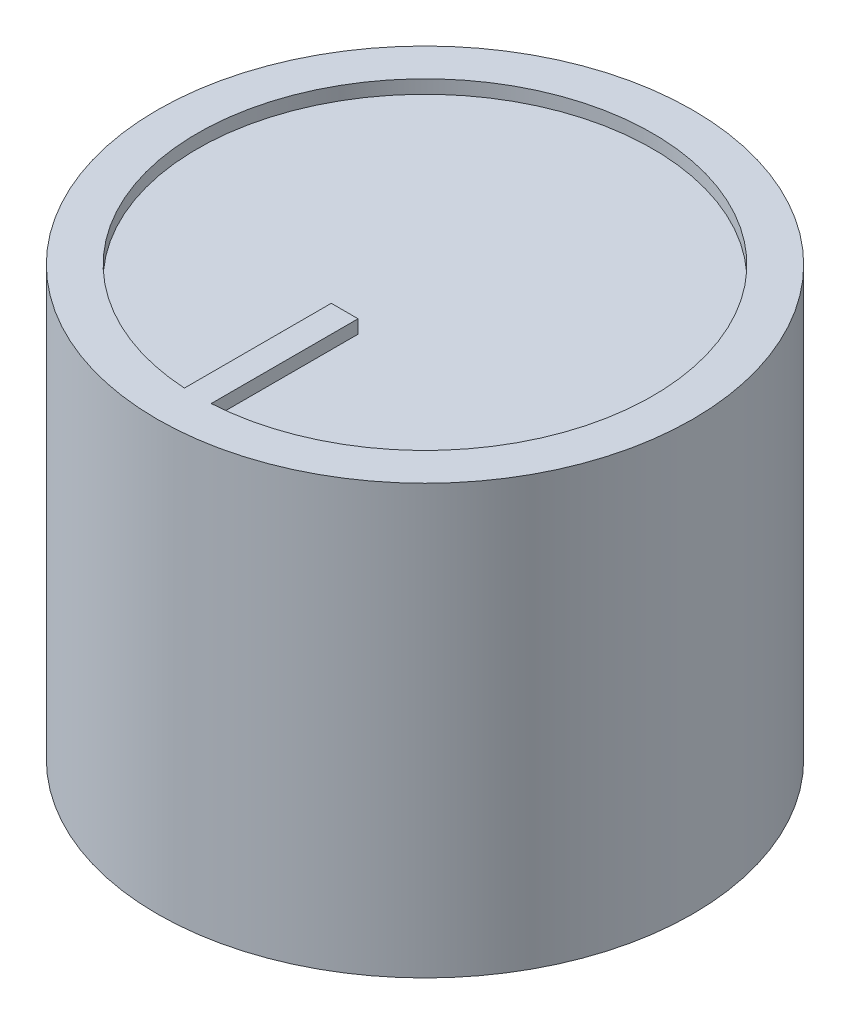
ISO-10303-21;
HEADER;
FILE_DESCRIPTION(('STEP AP214'),'2;1');
FILE_NAME('part.step','',(''),(''),'','','');
FILE_SCHEMA(('AUTOMOTIVE_DESIGN { 1 0 10303 214 1 1 1 1 }'));
ENDSEC;
DATA;
#1=APPLICATION_CONTEXT('core data for automotive mechanical design processes');
#2=APPLICATION_PROTOCOL_DEFINITION('international standard','automotive_design',2000,#1);
#3=PRODUCT_CONTEXT('',#1,'mechanical');
#4=PRODUCT('Part','Part','',(#3));
#5=PRODUCT_RELATED_PRODUCT_CATEGORY('part','',(#4));
#6=PRODUCT_DEFINITION_FORMATION('','',#4);
#7=PRODUCT_DEFINITION_CONTEXT('part definition',#1,'design');
#8=PRODUCT_DEFINITION('design','',#6,#7);
#9=PRODUCT_DEFINITION_SHAPE('','',#8);
#10=(LENGTH_UNIT() NAMED_UNIT(*) SI_UNIT(.MILLI.,.METRE.));
#11=(NAMED_UNIT(*) PLANE_ANGLE_UNIT() SI_UNIT($,.RADIAN.));
#12=(NAMED_UNIT(*) SI_UNIT($,.STERADIAN.) SOLID_ANGLE_UNIT());
#13=UNCERTAINTY_MEASURE_WITH_UNIT(LENGTH_MEASURE(1.E-05),#10,'distance_accuracy_value','');
#14=(GEOMETRIC_REPRESENTATION_CONTEXT(3) GLOBAL_UNCERTAINTY_ASSIGNED_CONTEXT((#13)) GLOBAL_UNIT_ASSIGNED_CONTEXT((#10,
#11,#12)) REPRESENTATION_CONTEXT('',''));
#15=CARTESIAN_POINT('',(0.,0.,0.));
#16=DIRECTION('',(0.,0.,1.));
#17=DIRECTION('',(1.,0.,0.));
#18=AXIS2_PLACEMENT_3D('',#15,#16,#17);
#19=CARTESIAN_POINT('',(0.,2.5,0.));
#20=DIRECTION('',(0.,1.,0.));
#21=DIRECTION('',(0.,0.,1.));
#22=AXIS2_PLACEMENT_3D('',#19,#20,#21);
#23=CYLINDRICAL_SURFACE('',#22,8.5);
#24=CARTESIAN_POINT('',(0.,3.,0.));
#25=DIRECTION('',(0.,1.,0.));
#26=DIRECTION('',(0.,0.,1.));
#27=AXIS2_PLACEMENT_3D('',#24,#25,#26);
#28=CIRCLE('',#27,8.5);
#29=CARTESIAN_POINT('',(0.49999999999999,3.,8.48528137423858));
#30=VERTEX_POINT('',#29);
#31=CARTESIAN_POINT('',(-0.500000000000007,3.,8.48528137423858));
#32=VERTEX_POINT('',#31);
#33=EDGE_CURVE('E83',#30,#32,#28,.T.);
#34=ORIENTED_EDGE('',*,*,#33,.T.);
#35=DIRECTION('',(0.,1.,0.));
#36=VECTOR('',#35,1.);
#37=CARTESIAN_POINT('',(-0.500000000000007,2.5,8.48528137423858));
#38=LINE('',#37,#36);
#39=CARTESIAN_POINT('',(-0.500000000000007,2.5,8.48528137423858));
#40=VERTEX_POINT('',#39);
#41=EDGE_CURVE('E102',#32,#40,#38,.F.);
#42=ORIENTED_EDGE('',*,*,#41,.T.);
#43=CARTESIAN_POINT('',(0.,2.5,0.));
#44=DIRECTION('',(0.,1.,0.));
#45=DIRECTION('',(0.,0.,1.));
#46=AXIS2_PLACEMENT_3D('',#43,#44,#45);
#47=CIRCLE('',#46,8.5);
#48=CARTESIAN_POINT('',(0.49999999999999,2.5,8.48528137423858));
#49=VERTEX_POINT('',#48);
#50=EDGE_CURVE('E104',#49,#40,#47,.T.);
#51=ORIENTED_EDGE('',*,*,#50,.F.);
#52=DIRECTION('',(0.,1.,0.));
#53=VECTOR('',#52,1.);
#54=CARTESIAN_POINT('',(0.49999999999999,2.5,8.48528137423858));
#55=LINE('',#54,#53);
#56=EDGE_CURVE('E86',#49,#30,#55,.T.);
#57=ORIENTED_EDGE('',*,*,#56,.T.);
#58=EDGE_LOOP('',(#34,#42,#51,#57));
#59=FACE_BOUND('',#58,.T.);
#60=ADVANCED_FACE('F34',(#59),#23,.F.);
#61=CARTESIAN_POINT('',(0.,2.5,8.5));
#62=DIRECTION('',(0.,1.,0.));
#63=DIRECTION('',(0.,0.,1.));
#64=AXIS2_PLACEMENT_3D('',#61,#62,#63);
#65=PLANE('',#64);
#66=ORIENTED_EDGE('',*,*,#50,.T.);
#67=DIRECTION('',(0.,0.,1.));
#68=VECTOR('',#67,1.);
#69=CARTESIAN_POINT('',(-0.500000000000007,2.5,3.));
#70=LINE('',#69,#68);
#71=CARTESIAN_POINT('',(-0.500000000000007,2.5,3.));
#72=VERTEX_POINT('',#71);
#73=EDGE_CURVE('E57',#72,#40,#70,.T.);
#74=ORIENTED_EDGE('',*,*,#73,.F.);
#75=DIRECTION('',(-1.,0.,0.));
#76=VECTOR('',#75,1.);
#77=CARTESIAN_POINT('',(-0.500000000000007,2.5,3.));
#78=LINE('',#77,#76);
#79=CARTESIAN_POINT('',(0.500000000000004,2.5,3.));
#80=VERTEX_POINT('',#79);
#81=EDGE_CURVE('E91',#80,#72,#78,.T.);
#82=ORIENTED_EDGE('',*,*,#81,.F.);
#83=DIRECTION('',(0.,0.,1.));
#84=VECTOR('',#83,1.);
#85=CARTESIAN_POINT('',(0.499999999999997,2.5,8.5));
#86=LINE('',#85,#84);
#87=EDGE_CURVE('E11',#80,#49,#86,.T.);
#88=ORIENTED_EDGE('',*,*,#87,.T.);
#89=EDGE_LOOP('',(#66,#74,#82,#88));
#90=FACE_BOUND('',#89,.T.);
#91=ADVANCED_FACE('F135',(#90),#65,.T.);
#92=CARTESIAN_POINT('',(0.,0.,0.));
#93=DIRECTION('',(0.,-1.,0.));
#94=DIRECTION('',(0.,0.,-1.));
#95=AXIS2_PLACEMENT_3D('',#92,#93,#94);
#96=PLANE('',#95);
#97=CARTESIAN_POINT('',(0.,0.,0.));
#98=DIRECTION('',(0.,1.,0.));
#99=DIRECTION('',(0.,0.,1.));
#100=AXIS2_PLACEMENT_3D('',#97,#98,#99);
#101=CIRCLE('',#100,3.);
#102=CARTESIAN_POINT('',(0.,0.,3.));
#103=VERTEX_POINT('',#102);
#104=EDGE_CURVE('E42',#103,#103,#101,.T.);
#105=ORIENTED_EDGE('',*,*,#104,.F.);
#106=EDGE_LOOP('',(#105));
#107=FACE_BOUND('',#106,.T.);
#108=ADVANCED_FACE('F36',(#107),#96,.T.);
#109=CARTESIAN_POINT('',(0.,2.5,0.));
#110=DIRECTION('',(0.,1.,0.));
#111=DIRECTION('',(0.,0.,1.));
#112=AXIS2_PLACEMENT_3D('',#109,#110,#111);
#113=CYLINDRICAL_SURFACE('',#112,3.);
#114=ORIENTED_EDGE('',*,*,#104,.T.);
#115=EDGE_LOOP('',(#114));
#116=FACE_BOUND('',#115,.T.);
#117=CARTESIAN_POINT('',(0.,-9.5,0.));
#118=DIRECTION('',(0.,1.,0.));
#119=DIRECTION('',(0.,0.,1.));
#120=AXIS2_PLACEMENT_3D('',#117,#118,#119);
#121=CIRCLE('',#120,3.);
#122=CARTESIAN_POINT('',(0.,-9.5,3.));
#123=VERTEX_POINT('',#122);
#124=EDGE_CURVE('E126',#123,#123,#121,.T.);
#125=ORIENTED_EDGE('',*,*,#124,.F.);
#126=EDGE_LOOP('',(#125));
#127=FACE_BOUND('',#126,.T.);
#128=ADVANCED_FACE('F131',(#116,#127),#113,.F.);
#129=CARTESIAN_POINT('',(0.,-9.5,3.));
#130=DIRECTION('',(0.,-1.,0.));
#131=DIRECTION('',(0.,0.,-1.));
#132=AXIS2_PLACEMENT_3D('',#129,#130,#131);
#133=PLANE('',#132);
#134=ORIENTED_EDGE('',*,*,#124,.T.);
#135=EDGE_LOOP('',(#134));
#136=FACE_BOUND('',#135,.T.);
#137=CARTESIAN_POINT('',(0.,-9.5,0.));
#138=DIRECTION('',(0.,1.,0.));
#139=DIRECTION('',(0.,0.,1.));
#140=AXIS2_PLACEMENT_3D('',#137,#138,#139);
#141=CIRCLE('',#140,4.5);
#142=CARTESIAN_POINT('',(0.,-9.5,4.50000000000001));
#143=VERTEX_POINT('',#142);
#144=EDGE_CURVE('E123',#143,#143,#141,.T.);
#145=ORIENTED_EDGE('',*,*,#144,.F.);
#146=EDGE_LOOP('',(#145));
#147=FACE_BOUND('',#146,.T.);
#148=ADVANCED_FACE('F140',(#136,#147),#133,.T.);
#149=CARTESIAN_POINT('',(0.,2.5,0.));
#150=DIRECTION('',(0.,1.,0.));
#151=DIRECTION('',(0.,0.,1.));
#152=AXIS2_PLACEMENT_3D('',#149,#150,#151);
#153=CYLINDRICAL_SURFACE('',#152,4.5);
#154=ORIENTED_EDGE('',*,*,#144,.T.);
#155=EDGE_LOOP('',(#154));
#156=FACE_BOUND('',#155,.T.);
#157=CARTESIAN_POINT('',(0.,-2.,0.));
#158=DIRECTION('',(0.,1.,0.));
#159=DIRECTION('',(0.,0.,1.));
#160=AXIS2_PLACEMENT_3D('',#157,#158,#159);
#161=CIRCLE('',#160,4.5);
#162=CARTESIAN_POINT('',(0.,-2.,4.50000000000001));
#163=VERTEX_POINT('',#162);
#164=EDGE_CURVE('E120',#163,#163,#161,.T.);
#165=ORIENTED_EDGE('',*,*,#164,.F.);
#166=EDGE_LOOP('',(#165));
#167=FACE_BOUND('',#166,.T.);
#168=ADVANCED_FACE('F168',(#156,#167),#153,.T.);
#169=CARTESIAN_POINT('',(0.,-2.,4.50000000000001));
#170=DIRECTION('',(0.,-1.,0.));
#171=DIRECTION('',(0.,0.,-1.));
#172=AXIS2_PLACEMENT_3D('',#169,#170,#171);
#173=PLANE('',#172);
#174=ORIENTED_EDGE('',*,*,#164,.T.);
#175=EDGE_LOOP('',(#174));
#176=FACE_BOUND('',#175,.T.);
#177=CARTESIAN_POINT('',(0.,-2.,0.));
#178=DIRECTION('',(0.,1.,0.));
#179=DIRECTION('',(0.,0.,1.));
#180=AXIS2_PLACEMENT_3D('',#177,#178,#179);
#181=CIRCLE('',#180,6.);
#182=CARTESIAN_POINT('',(0.,-2.,6.00000000000001));
#183=VERTEX_POINT('',#182);
#184=EDGE_CURVE('E117',#183,#183,#181,.T.);
#185=ORIENTED_EDGE('',*,*,#184,.F.);
#186=EDGE_LOOP('',(#185));
#187=FACE_BOUND('',#186,.T.);
#188=ADVANCED_FACE('F164',(#176,#187),#173,.T.);
#189=CARTESIAN_POINT('',(0.,2.5,0.));
#190=DIRECTION('',(0.,1.,0.));
#191=DIRECTION('',(0.,0.,1.));
#192=AXIS2_PLACEMENT_3D('',#189,#190,#191);
#193=CYLINDRICAL_SURFACE('',#192,6.);
#194=ORIENTED_EDGE('',*,*,#184,.T.);
#195=EDGE_LOOP('',(#194));
#196=FACE_BOUND('',#195,.T.);
#197=CARTESIAN_POINT('',(0.,-13.,0.));
#198=DIRECTION('',(0.,1.,0.));
#199=DIRECTION('',(0.,0.,1.));
#200=AXIS2_PLACEMENT_3D('',#197,#198,#199);
#201=CIRCLE('',#200,6.);
#202=CARTESIAN_POINT('',(0.,-13.,6.00000000000001));
#203=VERTEX_POINT('',#202);
#204=EDGE_CURVE('E114',#203,#203,#201,.T.);
#205=ORIENTED_EDGE('',*,*,#204,.F.);
#206=EDGE_LOOP('',(#205));
#207=FACE_BOUND('',#206,.T.);
#208=ADVANCED_FACE('F160',(#196,#207),#193,.F.);
#209=CARTESIAN_POINT('',(0.,-13.,6.00000000000001));
#210=DIRECTION('',(0.,-1.,0.));
#211=DIRECTION('',(0.,0.,-1.));
#212=AXIS2_PLACEMENT_3D('',#209,#210,#211);
#213=PLANE('',#212);
#214=ORIENTED_EDGE('',*,*,#204,.T.);
#215=EDGE_LOOP('',(#214));
#216=FACE_BOUND('',#215,.T.);
#217=CARTESIAN_POINT('',(0.,-13.,0.));
#218=DIRECTION('',(0.,1.,0.));
#219=DIRECTION('',(0.,0.,1.));
#220=AXIS2_PLACEMENT_3D('',#217,#218,#219);
#221=CIRCLE('',#220,10.);
#222=CARTESIAN_POINT('',(0.,-13.,10.));
#223=VERTEX_POINT('',#222);
#224=EDGE_CURVE('E111',#223,#223,#221,.T.);
#225=ORIENTED_EDGE('',*,*,#224,.F.);
#226=EDGE_LOOP('',(#225));
#227=FACE_BOUND('',#226,.T.);
#228=ADVANCED_FACE('F156',(#216,#227),#213,.T.);
#229=CARTESIAN_POINT('',(0.,2.5,0.));
#230=DIRECTION('',(0.,1.,0.));
#231=DIRECTION('',(0.,0.,1.));
#232=AXIS2_PLACEMENT_3D('',#229,#230,#231);
#233=CYLINDRICAL_SURFACE('',#232,10.);
#234=ORIENTED_EDGE('',*,*,#224,.T.);
#235=EDGE_LOOP('',(#234));
#236=FACE_BOUND('',#235,.T.);
#237=CARTESIAN_POINT('',(0.,3.,0.));
#238=DIRECTION('',(0.,1.,0.));
#239=DIRECTION('',(0.,0.,1.));
#240=AXIS2_PLACEMENT_3D('',#237,#238,#239);
#241=CIRCLE('',#240,10.);
#242=CARTESIAN_POINT('',(0.,3.,10.));
#243=VERTEX_POINT('',#242);
#244=EDGE_CURVE('E108',#243,#243,#241,.T.);
#245=ORIENTED_EDGE('',*,*,#244,.F.);
#246=EDGE_LOOP('',(#245));
#247=FACE_BOUND('',#246,.T.);
#248=ADVANCED_FACE('F153',(#236,#247),#233,.T.);
#249=CARTESIAN_POINT('',(0.,3.,10.));
#250=DIRECTION('',(0.,1.,0.));
#251=DIRECTION('',(0.,0.,1.));
#252=AXIS2_PLACEMENT_3D('',#249,#250,#251);
#253=PLANE('',#252);
#254=DIRECTION('',(0.,0.,1.));
#255=VECTOR('',#254,1.);
#256=CARTESIAN_POINT('',(-0.500000000000007,3.,3.));
#257=LINE('',#256,#255);
#258=CARTESIAN_POINT('',(-0.500000000000007,3.,3.));
#259=VERTEX_POINT('',#258);
#260=EDGE_CURVE('E87',#259,#32,#257,.T.);
#261=ORIENTED_EDGE('',*,*,#260,.T.);
#262=ORIENTED_EDGE('',*,*,#33,.F.);
#263=DIRECTION('',(0.,0.,-1.));
#264=VECTOR('',#263,1.);
#265=CARTESIAN_POINT('',(0.500000000000004,3.,3.));
#266=LINE('',#265,#264);
#267=CARTESIAN_POINT('',(0.500000000000004,3.,3.));
#268=VERTEX_POINT('',#267);
#269=EDGE_CURVE('E77',#30,#268,#266,.T.);
#270=ORIENTED_EDGE('',*,*,#269,.T.);
#271=DIRECTION('',(-1.,0.,0.));
#272=VECTOR('',#271,1.);
#273=CARTESIAN_POINT('',(-0.500000000000007,3.,3.));
#274=LINE('',#273,#272);
#275=EDGE_CURVE('E81',#268,#259,#274,.T.);
#276=ORIENTED_EDGE('',*,*,#275,.T.);
#277=EDGE_LOOP('',(#261,#262,#270,#276));
#278=FACE_BOUND('',#277,.T.);
#279=ORIENTED_EDGE('',*,*,#244,.T.);
#280=EDGE_LOOP('',(#279));
#281=FACE_BOUND('',#280,.T.);
#282=ADVANCED_FACE('F79',(#278,#281),#253,.T.);
#283=CARTESIAN_POINT('',(-0.500000000000007,8.59016994374948,3.));
#284=DIRECTION('',(1.,0.,0.));
#285=DIRECTION('',(0.,0.,-1.));
#286=AXIS2_PLACEMENT_3D('',#283,#284,#285);
#287=PLANE('',#286);
#288=ORIENTED_EDGE('',*,*,#41,.F.);
#289=ORIENTED_EDGE('',*,*,#260,.F.);
#290=DIRECTION('',(0.,-1.,0.));
#291=VECTOR('',#290,1.);
#292=CARTESIAN_POINT('',(-0.500000000000007,8.59016994374948,3.));
#293=LINE('',#292,#291);
#294=EDGE_CURVE('E94',#259,#72,#293,.T.);
#295=ORIENTED_EDGE('',*,*,#294,.T.);
#296=ORIENTED_EDGE('',*,*,#73,.T.);
#297=EDGE_LOOP('',(#288,#289,#295,#296));
#298=FACE_BOUND('',#297,.T.);
#299=ADVANCED_FACE('F152',(#298),#287,.F.);
#300=CARTESIAN_POINT('',(0.5,8.59016994374948,3.));
#301=DIRECTION('',(-1.,0.,0.));
#302=DIRECTION('',(0.,0.,1.));
#303=AXIS2_PLACEMENT_3D('',#300,#301,#302);
#304=PLANE('',#303);
#305=ORIENTED_EDGE('',*,*,#56,.F.);
#306=ORIENTED_EDGE('',*,*,#87,.F.);
#307=DIRECTION('',(0.,-1.,0.));
#308=VECTOR('',#307,1.);
#309=CARTESIAN_POINT('',(0.5,8.59016994374948,3.));
#310=LINE('',#309,#308);
#311=EDGE_CURVE('E49',#268,#80,#310,.T.);
#312=ORIENTED_EDGE('',*,*,#311,.F.);
#313=ORIENTED_EDGE('',*,*,#269,.F.);
#314=EDGE_LOOP('',(#305,#306,#312,#313));
#315=FACE_BOUND('',#314,.T.);
#316=ADVANCED_FACE('F89',(#315),#304,.F.);
#317=CARTESIAN_POINT('',(-0.500000000000007,8.59016994374948,3.));
#318=DIRECTION('',(0.,0.,1.));
#319=DIRECTION('',(1.,0.,0.));
#320=AXIS2_PLACEMENT_3D('',#317,#318,#319);
#321=PLANE('',#320);
#322=ORIENTED_EDGE('',*,*,#275,.F.);
#323=ORIENTED_EDGE('',*,*,#311,.T.);
#324=ORIENTED_EDGE('',*,*,#81,.T.);
#325=ORIENTED_EDGE('',*,*,#294,.F.);
#326=EDGE_LOOP('',(#322,#323,#324,#325));
#327=FACE_BOUND('',#326,.T.);
#328=ADVANCED_FACE('F93',(#327),#321,.F.);
#329=CLOSED_SHELL('',(#60,#91,#108,#128,#148,#168,#188,#208,#228,#248,#282,#299,#316,#328));
#330=MANIFOLD_SOLID_BREP('B2',#329);
#331=ADVANCED_BREP_SHAPE_REPRESENTATION('',(#18,#330),#14);
#332=SHAPE_DEFINITION_REPRESENTATION(#9,#331);
ENDSEC;
END-ISO-10303-21;
